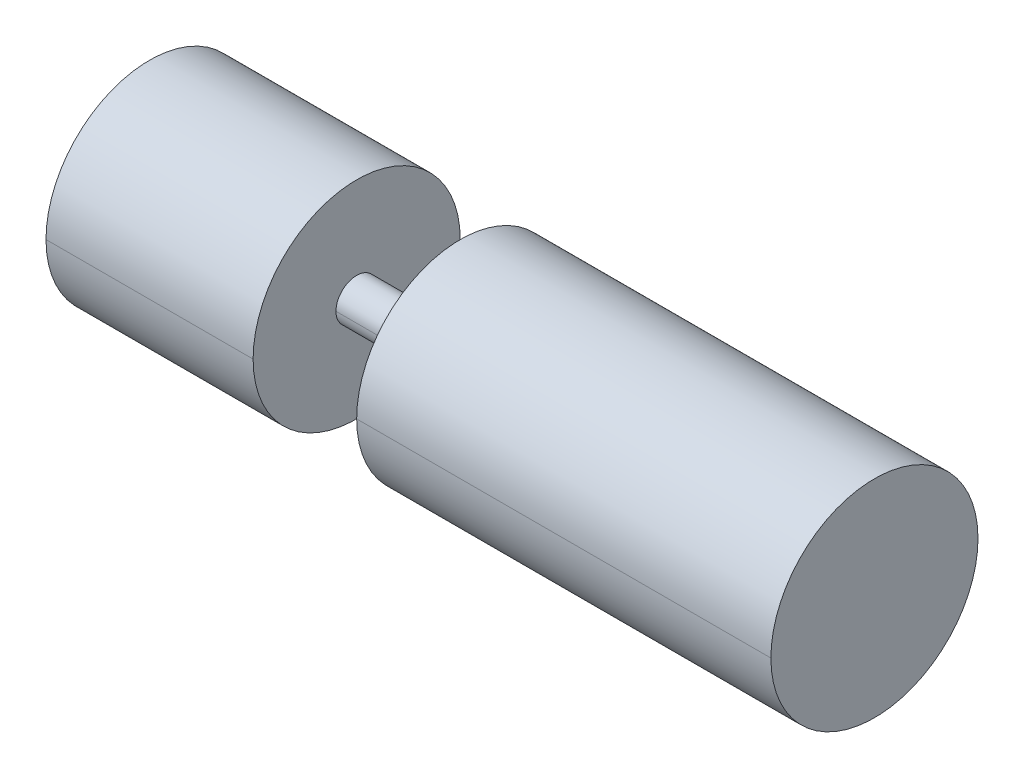
ISO-10303-21;
HEADER;
FILE_DESCRIPTION(('STEP AP214'),'2;1');
FILE_NAME('part.step','',(''),(''),'','','');
FILE_SCHEMA(('AUTOMOTIVE_DESIGN { 1 0 10303 214 1 1 1 1 }'));
ENDSEC;
DATA;
#1=APPLICATION_CONTEXT('core data for automotive mechanical design processes');
#2=APPLICATION_PROTOCOL_DEFINITION('international standard','automotive_design',2000,#1);
#3=PRODUCT_CONTEXT('',#1,'mechanical');
#4=PRODUCT('Part','Part','',(#3));
#5=PRODUCT_RELATED_PRODUCT_CATEGORY('part','',(#4));
#6=PRODUCT_DEFINITION_FORMATION('','',#4);
#7=PRODUCT_DEFINITION_CONTEXT('part definition',#1,'design');
#8=PRODUCT_DEFINITION('design','',#6,#7);
#9=PRODUCT_DEFINITION_SHAPE('','',#8);
#10=(LENGTH_UNIT() NAMED_UNIT(*) SI_UNIT(.MILLI.,.METRE.));
#11=(NAMED_UNIT(*) PLANE_ANGLE_UNIT() SI_UNIT($,.RADIAN.));
#12=(NAMED_UNIT(*) SI_UNIT($,.STERADIAN.) SOLID_ANGLE_UNIT());
#13=UNCERTAINTY_MEASURE_WITH_UNIT(LENGTH_MEASURE(1.E-05),#10,'distance_accuracy_value','');
#14=(GEOMETRIC_REPRESENTATION_CONTEXT(3) GLOBAL_UNCERTAINTY_ASSIGNED_CONTEXT((#13)) GLOBAL_UNIT_ASSIGNED_CONTEXT((#10,
#11,#12)) REPRESENTATION_CONTEXT('',''));
#15=CARTESIAN_POINT('',(0.,0.,0.));
#16=DIRECTION('',(0.,0.,1.));
#17=DIRECTION('',(1.,0.,0.));
#18=AXIS2_PLACEMENT_3D('',#15,#16,#17);
#19=CARTESIAN_POINT('',(300.,0.,0.));
#20=DIRECTION('',(1.,0.,0.));
#21=DIRECTION('',(0.,1.,0.));
#22=AXIS2_PLACEMENT_3D('',#19,#20,#21);
#23=PLANE('',#22);
#24=CARTESIAN_POINT('',(300.,0.,0.));
#25=DIRECTION('',(1.,0.,0.));
#26=DIRECTION('',(0.,0.,-1.));
#27=AXIS2_PLACEMENT_3D('',#24,#25,#26);
#28=CIRCLE('',#27,20.);
#29=CARTESIAN_POINT('',(300.,0.,20.));
#30=VERTEX_POINT('',#29);
#31=CARTESIAN_POINT('',(300.,0.,-20.));
#32=VERTEX_POINT('',#31);
#33=EDGE_CURVE('E71',#30,#32,#28,.T.);
#34=ORIENTED_EDGE('',*,*,#33,.T.);
#35=CARTESIAN_POINT('',(300.,0.,0.));
#36=DIRECTION('',(1.,0.,0.));
#37=DIRECTION('',(0.,0.,-1.));
#38=AXIS2_PLACEMENT_3D('',#35,#36,#37);
#39=CIRCLE('',#38,20.);
#40=EDGE_CURVE('E153',#32,#30,#39,.T.);
#41=ORIENTED_EDGE('',*,*,#40,.T.);
#42=EDGE_LOOP('',(#34,#41));
#43=FACE_BOUND('',#42,.T.);
#44=CARTESIAN_POINT('',(300.,0.,0.));
#45=DIRECTION('',(1.,0.,0.));
#46=DIRECTION('',(0.,0.,-1.));
#47=AXIS2_PLACEMENT_3D('',#44,#45,#46);
#48=CIRCLE('',#47,100.);
#49=CARTESIAN_POINT('',(300.,0.,100.));
#50=VERTEX_POINT('',#49);
#51=CARTESIAN_POINT('',(300.,0.,-100.));
#52=VERTEX_POINT('',#51);
#53=EDGE_CURVE('E10',#50,#52,#48,.T.);
#54=ORIENTED_EDGE('',*,*,#53,.F.);
#55=CARTESIAN_POINT('',(300.,0.,0.));
#56=DIRECTION('',(1.,0.,0.));
#57=DIRECTION('',(0.,0.,-1.));
#58=AXIS2_PLACEMENT_3D('',#55,#56,#57);
#59=CIRCLE('',#58,100.);
#60=EDGE_CURVE('E114',#52,#50,#59,.T.);
#61=ORIENTED_EDGE('',*,*,#60,.F.);
#62=EDGE_LOOP('',(#54,#61));
#63=FACE_BOUND('',#62,.T.);
#64=ADVANCED_FACE('F15',(#43,#63),#23,.F.);
#65=CARTESIAN_POINT('',(700.,0.,0.));
#66=DIRECTION('',(1.,0.,0.));
#67=DIRECTION('',(0.,1.,0.));
#68=AXIS2_PLACEMENT_3D('',#65,#66,#67);
#69=PLANE('',#68);
#70=CARTESIAN_POINT('',(700.,0.,0.));
#71=DIRECTION('',(1.,0.,0.));
#72=DIRECTION('',(0.,0.,-1.));
#73=AXIS2_PLACEMENT_3D('',#70,#71,#72);
#74=CIRCLE('',#73,100.);
#75=CARTESIAN_POINT('',(700.,0.,100.));
#76=VERTEX_POINT('',#75);
#77=CARTESIAN_POINT('',(700.,0.,-100.));
#78=VERTEX_POINT('',#77);
#79=EDGE_CURVE('E25',#76,#78,#74,.T.);
#80=ORIENTED_EDGE('',*,*,#79,.T.);
#81=CARTESIAN_POINT('',(700.,0.,0.));
#82=DIRECTION('',(1.,0.,0.));
#83=DIRECTION('',(0.,0.,-1.));
#84=AXIS2_PLACEMENT_3D('',#81,#82,#83);
#85=CIRCLE('',#84,100.);
#86=EDGE_CURVE('E101',#78,#76,#85,.T.);
#87=ORIENTED_EDGE('',*,*,#86,.T.);
#88=EDGE_LOOP('',(#80,#87));
#89=FACE_BOUND('',#88,.T.);
#90=ADVANCED_FACE('F17',(#89),#69,.T.);
#91=CARTESIAN_POINT('',(700.,0.,0.));
#92=DIRECTION('',(-1.,0.,0.));
#93=DIRECTION('',(0.,0.,1.));
#94=AXIS2_PLACEMENT_3D('',#91,#92,#93);
#95=CYLINDRICAL_SURFACE('',#94,100.);
#96=DIRECTION('',(-1.,0.,0.));
#97=VECTOR('',#96,1.);
#98=CARTESIAN_POINT('',(700.,0.,-100.));
#99=LINE('',#98,#97);
#100=EDGE_CURVE('E108',#78,#52,#99,.T.);
#101=ORIENTED_EDGE('',*,*,#100,.F.);
#102=ORIENTED_EDGE('',*,*,#79,.F.);
#103=DIRECTION('',(-1.,0.,0.));
#104=VECTOR('',#103,1.);
#105=CARTESIAN_POINT('',(700.,0.,100.));
#106=LINE('',#105,#104);
#107=EDGE_CURVE('E117',#76,#50,#106,.T.);
#108=ORIENTED_EDGE('',*,*,#107,.T.);
#109=ORIENTED_EDGE('',*,*,#53,.T.);
#110=EDGE_LOOP('',(#101,#102,#108,#109));
#111=FACE_BOUND('',#110,.T.);
#112=ADVANCED_FACE('F109',(#111),#95,.T.);
#113=CARTESIAN_POINT('',(300.,0.,0.));
#114=DIRECTION('',(-1.,0.,0.));
#115=DIRECTION('',(0.,0.,1.));
#116=AXIS2_PLACEMENT_3D('',#113,#114,#115);
#117=CYLINDRICAL_SURFACE('',#116,20.);
#118=DIRECTION('',(-1.,0.,0.));
#119=VECTOR('',#118,1.);
#120=CARTESIAN_POINT('',(300.,0.,-20.));
#121=LINE('',#120,#119);
#122=CARTESIAN_POINT('',(200.,0.,-20.));
#123=VERTEX_POINT('',#122);
#124=EDGE_CURVE('E145',#32,#123,#121,.T.);
#125=ORIENTED_EDGE('',*,*,#124,.F.);
#126=ORIENTED_EDGE('',*,*,#33,.F.);
#127=DIRECTION('',(-1.,0.,0.));
#128=VECTOR('',#127,1.);
#129=CARTESIAN_POINT('',(300.,0.,20.));
#130=LINE('',#129,#128);
#131=CARTESIAN_POINT('',(200.,0.,20.));
#132=VERTEX_POINT('',#131);
#133=EDGE_CURVE('E139',#30,#132,#130,.T.);
#134=ORIENTED_EDGE('',*,*,#133,.T.);
#135=CARTESIAN_POINT('',(200.,0.,0.));
#136=DIRECTION('',(1.,0.,0.));
#137=DIRECTION('',(0.,0.,-1.));
#138=AXIS2_PLACEMENT_3D('',#135,#136,#137);
#139=CIRCLE('',#138,20.);
#140=EDGE_CURVE('E80',#132,#123,#139,.T.);
#141=ORIENTED_EDGE('',*,*,#140,.T.);
#142=EDGE_LOOP('',(#125,#126,#134,#141));
#143=FACE_BOUND('',#142,.T.);
#144=ADVANCED_FACE('F179',(#143),#117,.T.);
#145=CARTESIAN_POINT('',(0.,0.,0.));
#146=DIRECTION('',(1.,0.,0.));
#147=DIRECTION('',(0.,1.,0.));
#148=AXIS2_PLACEMENT_3D('',#145,#146,#147);
#149=PLANE('',#148);
#150=CARTESIAN_POINT('',(0.,0.,0.));
#151=DIRECTION('',(1.,0.,0.));
#152=DIRECTION('',(0.,0.,-1.));
#153=AXIS2_PLACEMENT_3D('',#150,#151,#152);
#154=CIRCLE('',#153,100.);
#155=CARTESIAN_POINT('',(0.,0.,100.));
#156=VERTEX_POINT('',#155);
#157=CARTESIAN_POINT('',(0.,0.,-100.));
#158=VERTEX_POINT('',#157);
#159=EDGE_CURVE('E38',#156,#158,#154,.T.);
#160=ORIENTED_EDGE('',*,*,#159,.F.);
#161=CARTESIAN_POINT('',(0.,0.,0.));
#162=DIRECTION('',(1.,0.,0.));
#163=DIRECTION('',(0.,0.,-1.));
#164=AXIS2_PLACEMENT_3D('',#161,#162,#163);
#165=CIRCLE('',#164,100.);
#166=EDGE_CURVE('E134',#158,#156,#165,.T.);
#167=ORIENTED_EDGE('',*,*,#166,.F.);
#168=EDGE_LOOP('',(#160,#167));
#169=FACE_BOUND('',#168,.T.);
#170=ADVANCED_FACE('F177',(#169),#149,.F.);
#171=CARTESIAN_POINT('',(200.,0.,0.));
#172=DIRECTION('',(1.,0.,0.));
#173=DIRECTION('',(0.,1.,0.));
#174=AXIS2_PLACEMENT_3D('',#171,#172,#173);
#175=PLANE('',#174);
#176=ORIENTED_EDGE('',*,*,#140,.F.);
#177=CARTESIAN_POINT('',(200.,0.,0.));
#178=DIRECTION('',(1.,0.,0.));
#179=DIRECTION('',(0.,0.,-1.));
#180=AXIS2_PLACEMENT_3D('',#177,#178,#179);
#181=CIRCLE('',#180,20.);
#182=EDGE_CURVE('E142',#123,#132,#181,.T.);
#183=ORIENTED_EDGE('',*,*,#182,.F.);
#184=EDGE_LOOP('',(#176,#183));
#185=FACE_BOUND('',#184,.T.);
#186=CARTESIAN_POINT('',(200.,0.,0.));
#187=DIRECTION('',(1.,0.,0.));
#188=DIRECTION('',(0.,0.,-1.));
#189=AXIS2_PLACEMENT_3D('',#186,#187,#188);
#190=CIRCLE('',#189,100.);
#191=CARTESIAN_POINT('',(200.,0.,100.));
#192=VERTEX_POINT('',#191);
#193=CARTESIAN_POINT('',(200.,0.,-100.));
#194=VERTEX_POINT('',#193);
#195=EDGE_CURVE('E128',#192,#194,#190,.T.);
#196=ORIENTED_EDGE('',*,*,#195,.T.);
#197=CARTESIAN_POINT('',(200.,0.,0.));
#198=DIRECTION('',(1.,0.,0.));
#199=DIRECTION('',(0.,0.,-1.));
#200=AXIS2_PLACEMENT_3D('',#197,#198,#199);
#201=CIRCLE('',#200,100.);
#202=EDGE_CURVE('E135',#194,#192,#201,.T.);
#203=ORIENTED_EDGE('',*,*,#202,.T.);
#204=EDGE_LOOP('',(#196,#203));
#205=FACE_BOUND('',#204,.T.);
#206=ADVANCED_FACE('F169',(#185,#205),#175,.T.);
#207=CARTESIAN_POINT('',(200.,0.,0.));
#208=DIRECTION('',(-1.,0.,0.));
#209=DIRECTION('',(0.,0.,1.));
#210=AXIS2_PLACEMENT_3D('',#207,#208,#209);
#211=CYLINDRICAL_SURFACE('',#210,100.);
#212=DIRECTION('',(-1.,0.,0.));
#213=VECTOR('',#212,1.);
#214=CARTESIAN_POINT('',(200.,0.,-100.));
#215=LINE('',#214,#213);
#216=EDGE_CURVE('E19',#194,#158,#215,.T.);
#217=ORIENTED_EDGE('',*,*,#216,.F.);
#218=ORIENTED_EDGE('',*,*,#195,.F.);
#219=DIRECTION('',(-1.,0.,0.));
#220=VECTOR('',#219,1.);
#221=CARTESIAN_POINT('',(200.,0.,100.));
#222=LINE('',#221,#220);
#223=EDGE_CURVE('E131',#192,#156,#222,.T.);
#224=ORIENTED_EDGE('',*,*,#223,.T.);
#225=ORIENTED_EDGE('',*,*,#159,.T.);
#226=EDGE_LOOP('',(#217,#218,#224,#225));
#227=FACE_BOUND('',#226,.T.);
#228=ADVANCED_FACE('F173',(#227),#211,.T.);
#229=CARTESIAN_POINT('',(200.,0.,0.));
#230=DIRECTION('',(-1.,0.,0.));
#231=DIRECTION('',(0.,0.,1.));
#232=AXIS2_PLACEMENT_3D('',#229,#230,#231);
#233=CYLINDRICAL_SURFACE('',#232,100.);
#234=ORIENTED_EDGE('',*,*,#202,.F.);
#235=ORIENTED_EDGE('',*,*,#216,.T.);
#236=ORIENTED_EDGE('',*,*,#166,.T.);
#237=ORIENTED_EDGE('',*,*,#223,.F.);
#238=EDGE_LOOP('',(#234,#235,#236,#237));
#239=FACE_BOUND('',#238,.T.);
#240=ADVANCED_FACE('F176',(#239),#233,.T.);
#241=CARTESIAN_POINT('',(300.,0.,0.));
#242=DIRECTION('',(-1.,0.,0.));
#243=DIRECTION('',(0.,0.,1.));
#244=AXIS2_PLACEMENT_3D('',#241,#242,#243);
#245=CYLINDRICAL_SURFACE('',#244,20.);
#246=ORIENTED_EDGE('',*,*,#40,.F.);
#247=ORIENTED_EDGE('',*,*,#124,.T.);
#248=ORIENTED_EDGE('',*,*,#182,.T.);
#249=ORIENTED_EDGE('',*,*,#133,.F.);
#250=EDGE_LOOP('',(#246,#247,#248,#249));
#251=FACE_BOUND('',#250,.T.);
#252=ADVANCED_FACE('F200',(#251),#245,.T.);
#253=CARTESIAN_POINT('',(700.,0.,0.));
#254=DIRECTION('',(-1.,0.,0.));
#255=DIRECTION('',(0.,0.,1.));
#256=AXIS2_PLACEMENT_3D('',#253,#254,#255);
#257=CYLINDRICAL_SURFACE('',#256,100.);
#258=ORIENTED_EDGE('',*,*,#86,.F.);
#259=ORIENTED_EDGE('',*,*,#100,.T.);
#260=ORIENTED_EDGE('',*,*,#60,.T.);
#261=ORIENTED_EDGE('',*,*,#107,.F.);
#262=EDGE_LOOP('',(#258,#259,#260,#261));
#263=FACE_BOUND('',#262,.T.);
#264=ADVANCED_FACE('F116',(#263),#257,.T.);
#265=CLOSED_SHELL('',(#64,#90,#112,#144,#170,#206,#228,#240,#252,#264));
#266=MANIFOLD_SOLID_BREP('B1',#265);
#267=ADVANCED_BREP_SHAPE_REPRESENTATION('',(#18,#266),#14);
#268=SHAPE_DEFINITION_REPRESENTATION(#9,#267);
ENDSEC;
END-ISO-10303-21;
